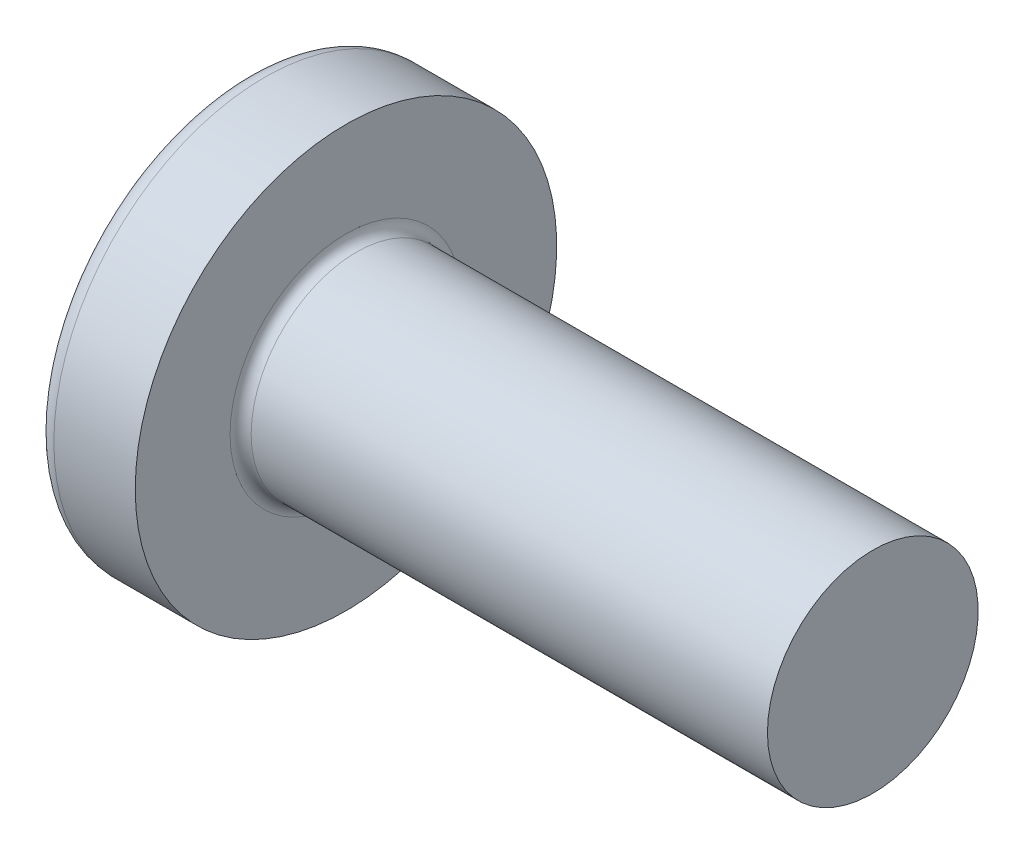
ISO-10303-21;
HEADER;
FILE_DESCRIPTION(('STEP AP214'),'2;1');
FILE_NAME('part.step','',(''),(''),'','','');
FILE_SCHEMA(('AUTOMOTIVE_DESIGN { 1 0 10303 214 1 1 1 1 }'));
ENDSEC;
DATA;
#1=APPLICATION_CONTEXT('core data for automotive mechanical design processes');
#2=APPLICATION_PROTOCOL_DEFINITION('international standard','automotive_design',2000,#1);
#3=PRODUCT_CONTEXT('',#1,'mechanical');
#4=PRODUCT('Part','Part','',(#3));
#5=PRODUCT_RELATED_PRODUCT_CATEGORY('part','',(#4));
#6=PRODUCT_DEFINITION_FORMATION('','',#4);
#7=PRODUCT_DEFINITION_CONTEXT('part definition',#1,'design');
#8=PRODUCT_DEFINITION('design','',#6,#7);
#9=PRODUCT_DEFINITION_SHAPE('','',#8);
#10=(LENGTH_UNIT() NAMED_UNIT(*) SI_UNIT(.MILLI.,.METRE.));
#11=(NAMED_UNIT(*) PLANE_ANGLE_UNIT() SI_UNIT($,.RADIAN.));
#12=(NAMED_UNIT(*) SI_UNIT($,.STERADIAN.) SOLID_ANGLE_UNIT());
#13=UNCERTAINTY_MEASURE_WITH_UNIT(LENGTH_MEASURE(1.E-05),#10,'distance_accuracy_value','');
#14=(GEOMETRIC_REPRESENTATION_CONTEXT(3) GLOBAL_UNCERTAINTY_ASSIGNED_CONTEXT((#13)) GLOBAL_UNIT_ASSIGNED_CONTEXT((#10,
#11,#12)) REPRESENTATION_CONTEXT('',''));
#15=CARTESIAN_POINT('',(0.,0.,0.));
#16=DIRECTION('',(0.,0.,1.));
#17=DIRECTION('',(1.,0.,0.));
#18=AXIS2_PLACEMENT_3D('',#15,#16,#17);
#19=CARTESIAN_POINT('',(0.,-2.15,-0.515));
#20=DIRECTION('',(0.446197753347436,-0.894934391398443,0.));
#21=DIRECTION('',(0.894934391398443,0.446197753347436,0.));
#22=AXIS2_PLACEMENT_3D('',#19,#20,#21);
#23=PLANE('',#22);
#24=DIRECTION('',(0.,0.,1.));
#25=VECTOR('',#24,1.);
#26=CARTESIAN_POINT('',(2.34,-0.983319232260743,-0.515));
#27=LINE('',#26,#25);
#28=CARTESIAN_POINT('',(2.34,-0.983319232260742,-0.515));
#29=VERTEX_POINT('',#28);
#30=CARTESIAN_POINT('',(2.34,-0.983319232260743,0.515));
#31=VERTEX_POINT('',#30);
#32=EDGE_CURVE('E152',#29,#31,#27,.T.);
#33=ORIENTED_EDGE('',*,*,#32,.F.);
#34=DIRECTION('',(0.894934391398443,0.446197753347436,0.));
#35=VECTOR('',#34,1.);
#36=CARTESIAN_POINT('',(0.331830520157853,-1.98455543332603,-0.515));
#37=LINE('',#36,#35);
#38=CARTESIAN_POINT('',(0.331830520157854,-1.98455543332603,-0.515));
#39=VERTEX_POINT('',#38);
#40=EDGE_CURVE('E156',#39,#29,#37,.T.);
#41=ORIENTED_EDGE('',*,*,#40,.F.);
#42=CARTESIAN_POINT('',(0.331830520157854,-1.98455543332603,0.514999999999998));
#43=CARTESIAN_POINT('',(0.319498798424873,-1.99070380194952,0.343333333333332));
#44=CARTESIAN_POINT('',(0.313332937558384,-1.99377798626127,0.171666666666665));
#45=CARTESIAN_POINT('',(0.313332937558389,-1.99377798626128,-0.171666666666671));
#46=CARTESIAN_POINT('',(0.319498798424884,-1.99070380194955,-0.343333333333342));
#47=CARTESIAN_POINT('',(0.331830520157871,-1.98455543332607,-0.515000000000013));
#48=B_SPLINE_CURVE_WITH_KNOTS('',3,(#42,#43,#44,#45,#46,#47),.UNSPECIFIED.,.F.,.F.,(4,2,4),(0.,
0.515414605967532,1.03082921193508),.UNSPECIFIED.);
#49=CARTESIAN_POINT('',(0.331830520157854,-1.98455543332603,0.515));
#50=VERTEX_POINT('',#49);
#51=EDGE_CURVE('E140',#50,#39,#48,.T.);
#52=ORIENTED_EDGE('',*,*,#51,.F.);
#53=DIRECTION('',(-0.894934391398443,-0.446197753347436,0.));
#54=VECTOR('',#53,1.);
#55=CARTESIAN_POINT('',(2.34,-0.983319232260743,0.515));
#56=LINE('',#55,#54);
#57=EDGE_CURVE('E170',#31,#50,#56,.T.);
#58=ORIENTED_EDGE('',*,*,#57,.F.);
#59=EDGE_LOOP('',(#33,#41,#52,#58));
#60=FACE_BOUND('',#59,.T.);
#61=ADVANCED_FACE('F17',(#60),#23,.F.);
#62=CARTESIAN_POINT('',(0.,-2.15,0.514999999999999));
#63=DIRECTION('',(0.,0.,-1.));
#64=DIRECTION('',(-1.,0.,0.));
#65=AXIS2_PLACEMENT_3D('',#62,#63,#64);
#66=PLANE('',#65);
#67=DIRECTION('',(0.,1.,0.));
#68=VECTOR('',#67,1.);
#69=CARTESIAN_POINT('',(2.34,-2.15,0.515));
#70=LINE('',#69,#68);
#71=CARTESIAN_POINT('',(2.34000000000175,-0.677477674907183,0.51499999999998));
#72=VERTEX_POINT('',#71);
#73=EDGE_CURVE('E334',#72,#31,#70,.F.);
#74=ORIENTED_EDGE('',*,*,#73,.T.);
#75=ORIENTED_EDGE('',*,*,#57,.T.);
#76=CARTESIAN_POINT('',(0.331830520157854,-1.98455543332603,0.515000000000001));
#77=CARTESIAN_POINT('',(0.273182530445949,-1.80216454181507,0.515000000000023));
#78=CARTESIAN_POINT('',(0.222773490743651,-1.61790695532938,0.515000000000022));
#79=CARTESIAN_POINT('',(0.138433311358271,-1.24565839240852,0.514999999999977));
#80=CARTESIAN_POINT('',(0.104502171675189,-1.05766741597335,0.514999999999933));
#81=CARTESIAN_POINT('',(0.0788099820017152,-0.867809744563443,0.514999999999866));
#82=B_SPLINE_CURVE_WITH_KNOTS('',3,(#76,#77,#78,#79,#80,#81),.UNSPECIFIED.,.F.,.F.,(4,2,4),(0.,
0.573085827037425,1.14617165407485),.UNSPECIFIED.);
#83=CARTESIAN_POINT('',(0.0788099820150379,-0.867809744561917,0.514999999999933));
#84=VERTEX_POINT('',#83);
#85=EDGE_CURVE('E147',#50,#84,#82,.T.);
#86=ORIENTED_EDGE('',*,*,#85,.T.);
#87=CARTESIAN_POINT('',(0.0788099820105211,-0.867809744561842,0.514999999999999));
#88=CARTESIAN_POINT('',(0.392213734002262,-0.842304642325876,0.514999999999999));
#89=CARTESIAN_POINT('',(0.70559787355606,-0.816547301111019,0.515));
#90=CARTESIAN_POINT('',(1.33229966547313,-0.76425626320608,0.515));
#91=CARTESIAN_POINT('',(1.64561731816469,-0.737722570443666,0.515));
#92=CARTESIAN_POINT('',(2.08593418824368,-0.69969155696372,0.515));
#93=CARTESIAN_POINT('',(2.21297124645575,-0.68863226058366,0.515));
#94=CARTESIAN_POINT('',(2.34000000000109,-0.677477674906791,0.515));
#95=B_SPLINE_CURVE_WITH_KNOTS('',3,(#87,#88,#89,#90,#91,#92,#93,#94),.UNSPECIFIED.,.F.,.F.,(4,2,
2,4),(0.,0.943320959581089,1.88663714759769,2.26918969179948),.UNSPECIFIED.);
#96=EDGE_CURVE('E159',#84,#72,#95,.T.);
#97=ORIENTED_EDGE('',*,*,#96,.T.);
#98=EDGE_LOOP('',(#74,#75,#86,#97));
#99=FACE_BOUND('',#98,.T.);
#100=ADVANCED_FACE('F509',(#99),#66,.T.);
#101=CARTESIAN_POINT('',(0.,2.15,-0.515));
#102=DIRECTION('',(0.,0.,1.));
#103=DIRECTION('',(1.,0.,0.));
#104=AXIS2_PLACEMENT_3D('',#101,#102,#103);
#105=PLANE('',#104);
#106=CARTESIAN_POINT('',(0.0788099820017082,-0.867809744563347,-0.515000000000002));
#107=CARTESIAN_POINT('',(0.104502171675179,-1.05766741597327,-0.515000000000001));
#108=CARTESIAN_POINT('',(0.138433311358259,-1.24565839240845,-0.515));
#109=CARTESIAN_POINT('',(0.222773490743641,-1.61790695532935,-0.515));
#110=CARTESIAN_POINT('',(0.273182530445943,-1.80216454181506,-0.514999999999999));
#111=CARTESIAN_POINT('',(0.331830520157854,-1.98455543332603,-0.514999999999999));
#112=B_SPLINE_CURVE_WITH_KNOTS('',3,(#106,#107,#108,#109,#110,#111),.UNSPECIFIED.,.F.,.F.,(4,2,
4),(0.,0.573085827037473,1.14617165407495),.UNSPECIFIED.);
#113=CARTESIAN_POINT('',(0.0788099820061147,-0.867809744562595,-0.515000000000001));
#114=VERTEX_POINT('',#113);
#115=EDGE_CURVE('E144',#114,#39,#112,.T.);
#116=ORIENTED_EDGE('',*,*,#115,.T.);
#117=ORIENTED_EDGE('',*,*,#40,.T.);
#118=DIRECTION('',(0.,1.,0.));
#119=VECTOR('',#118,1.);
#120=CARTESIAN_POINT('',(2.34,2.15,-0.515));
#121=LINE('',#120,#119);
#122=CARTESIAN_POINT('',(2.34000000000175,-0.677477674907168,-0.515));
#123=VERTEX_POINT('',#122);
#124=EDGE_CURVE('E166',#29,#123,#121,.T.);
#125=ORIENTED_EDGE('',*,*,#124,.T.);
#126=CARTESIAN_POINT('',(2.34000000000109,-0.677477674906791,-0.515));
#127=CARTESIAN_POINT('',(2.07584465982531,-0.700667758110798,-0.515));
#128=CARTESIAN_POINT('',(1.81165398196259,-0.723450497756089,-0.515));
#129=CARTESIAN_POINT('',(1.28321771173505,-0.768360358266413,-0.515));
#130=CARTESIAN_POINT('',(1.01897211955267,-0.79048748127564,-0.515));
#131=CARTESIAN_POINT('',(0.642063816057716,-0.821692201389346,-0.515));
#132=CARTESIAN_POINT('',(0.529417831854457,-0.830972904506625,-0.515));
#133=CARTESIAN_POINT('',(0.304118917866834,-0.849451547308498,-0.515));
#134=CARTESIAN_POINT('',(0.191465988073096,-0.858649486878829,-0.515));
#135=CARTESIAN_POINT('',(0.078809982010521,-0.867809744561842,-0.515));
#136=B_SPLINE_CURVE_WITH_KNOTS('',3,(#126,#127,#128,#129,#130,#131,#132,#133,#134,#135),
.UNSPECIFIED.,.F.,.F.,(4,2,2,2,4),(0.,0.795513032095966,1.59102346217911,1.93010639275618,
2.26918979140427),.UNSPECIFIED.);
#137=EDGE_CURVE('E163',#123,#114,#136,.T.);
#138=ORIENTED_EDGE('',*,*,#137,.T.);
#139=EDGE_LOOP('',(#116,#117,#125,#138));
#140=FACE_BOUND('',#139,.T.);
#141=ADVANCED_FACE('F161',(#140),#105,.T.);
#142=CARTESIAN_POINT('',(0.0788099821420474,0.,0.));
#143=DIRECTION('',(-1.,0.,0.));
#144=DIRECTION('',(0.,0.,1.));
#145=AXIS2_PLACEMENT_3D('',#142,#143,#144);
#146=CONICAL_SURFACE('',#145,1.00911780914714,0.0698131700804186);
#147=CARTESIAN_POINT('',(2.34000000000043,-0.515000000000002,0.677477674906847));
#148=CARTESIAN_POINT('',(2.07584465982464,-0.515000000000003,0.700667758110854));
#149=CARTESIAN_POINT('',(1.81165398196191,-0.515000000000003,0.723450497756147));
#150=CARTESIAN_POINT('',(1.28321771173434,-0.515000000000003,0.768360358266472));
#151=CARTESIAN_POINT('',(1.01897211955194,-0.515000000000002,0.790487481275699));
#152=CARTESIAN_POINT('',(0.642063816056353,-0.515000000000003,0.821692201389457));
#153=CARTESIAN_POINT('',(0.529417831852476,-0.515000000000003,0.830972904506786));
#154=CARTESIAN_POINT('',(0.304118917863614,-0.515000000000003,0.84945154730876));
#155=CARTESIAN_POINT('',(0.191465988069257,-0.515000000000003,0.85864948687914));
#156=CARTESIAN_POINT('',(0.0788099820060616,-0.515000000000003,0.867809744562203));
#157=B_SPLINE_CURVE_WITH_KNOTS('',3,(#147,#148,#149,#150,#151,#152,#153,#154,#155,#156),
.UNSPECIFIED.,.F.,.F.,(4,2,2,2,4),(0.,0.795513032096009,1.5910234621792,1.93010639275813,
2.26918979140808),.UNSPECIFIED.);
#158=CARTESIAN_POINT('',(2.34000000000175,-0.515000000000003,0.677477674907166));
#159=VERTEX_POINT('',#158);
#160=CARTESIAN_POINT('',(0.0788099820150116,-0.515000000000002,0.867809744611743));
#161=VERTEX_POINT('',#160);
#162=EDGE_CURVE('E315',#159,#161,#157,.T.);
#163=ORIENTED_EDGE('',*,*,#162,.F.);
#164=CARTESIAN_POINT('',(2.34000000000378,0.,0.));
#165=DIRECTION('',(-1.,0.,0.));
#166=DIRECTION('',(0.,0.,1.));
#167=AXIS2_PLACEMENT_3D('',#164,#165,#166);
#168=CIRCLE('',#167,0.850999999997271);
#169=EDGE_CURVE('E323',#72,#159,#168,.T.);
#170=ORIENTED_EDGE('',*,*,#169,.F.);
#171=ORIENTED_EDGE('',*,*,#96,.F.);
#172=CARTESIAN_POINT('',(0.0788099820283605,0.,0.));
#173=DIRECTION('',(-1.,0.,0.));
#174=DIRECTION('',(0.,0.,1.));
#175=AXIS2_PLACEMENT_3D('',#172,#173,#174);
#176=CIRCLE('',#175,1.00911780915509);
#177=EDGE_CURVE('E326',#161,#84,#176,.F.);
#178=ORIENTED_EDGE('',*,*,#177,.F.);
#179=EDGE_LOOP('',(#163,#170,#171,#178));
#180=FACE_BOUND('',#179,.T.);
#181=ADVANCED_FACE('F498',(#180),#146,.F.);
#182=CARTESIAN_POINT('',(0.0788099821420474,0.,0.));
#183=DIRECTION('',(-1.,0.,0.));
#184=DIRECTION('',(0.,0.,1.));
#185=AXIS2_PLACEMENT_3D('',#182,#183,#184);
#186=CONICAL_SURFACE('',#185,1.00911780914714,0.0698131700804186);
#187=CARTESIAN_POINT('',(0.0788099820060611,-0.514999999999996,-0.867809744562207));
#188=CARTESIAN_POINT('',(0.392213733997899,-0.514999999999996,-0.842304642326235));
#189=CARTESIAN_POINT('',(0.705597873551794,-0.514999999999997,-0.816547301111373));
#190=CARTESIAN_POINT('',(1.33229966546905,-0.514999999999997,-0.764256263206425));
#191=CARTESIAN_POINT('',(1.64561731816071,-0.514999999999997,-0.737722570444007));
#192=CARTESIAN_POINT('',(2.08593418824088,-0.514999999999997,-0.699691556963965));
#193=CARTESIAN_POINT('',(2.21297124645402,-0.514999999999997,-0.688632260583813));
#194=CARTESIAN_POINT('',(2.34000000000043,-0.514999999999998,-0.677477674906851));
#195=B_SPLINE_CURVE_WITH_KNOTS('',3,(#187,#188,#189,#190,#191,#192,#193,#194),.UNSPECIFIED.,.F.,
.F.,(4,2,2,4),(0.,0.94332095958138,1.88663714759827,2.2691896918033),.UNSPECIFIED.);
#196=CARTESIAN_POINT('',(0.0788099820172106,-0.514999999999994,-0.867809744611342));
#197=VERTEX_POINT('',#196);
#198=CARTESIAN_POINT('',(2.34000000000175,-0.514999999999998,-0.67747767490717));
#199=VERTEX_POINT('',#198);
#200=EDGE_CURVE('E308',#197,#199,#195,.T.);
#201=ORIENTED_EDGE('',*,*,#200,.F.);
#202=CARTESIAN_POINT('',(0.0788099820283605,0.,0.));
#203=DIRECTION('',(-1.,0.,0.));
#204=DIRECTION('',(0.,0.,1.));
#205=AXIS2_PLACEMENT_3D('',#202,#203,#204);
#206=CIRCLE('',#205,1.00911780915509);
#207=EDGE_CURVE('E322',#114,#197,#206,.F.);
#208=ORIENTED_EDGE('',*,*,#207,.F.);
#209=ORIENTED_EDGE('',*,*,#137,.F.);
#210=CARTESIAN_POINT('',(2.34000000000378,0.,0.));
#211=DIRECTION('',(-1.,0.,0.));
#212=DIRECTION('',(0.,0.,1.));
#213=AXIS2_PLACEMENT_3D('',#210,#211,#212);
#214=CIRCLE('',#213,0.850999999997271);
#215=EDGE_CURVE('E316',#199,#123,#214,.T.);
#216=ORIENTED_EDGE('',*,*,#215,.F.);
#217=EDGE_LOOP('',(#201,#208,#209,#216));
#218=FACE_BOUND('',#217,.T.);
#219=ADVANCED_FACE('F484',(#218),#186,.F.);
#220=CARTESIAN_POINT('',(0.,-0.514999999999992,-2.15));
#221=DIRECTION('',(0.,1.,0.));
#222=DIRECTION('',(0.,0.,1.));
#223=AXIS2_PLACEMENT_3D('',#220,#221,#222);
#224=PLANE('',#223);
#225=CARTESIAN_POINT('',(6.5,-0.515000000000002,0.));
#226=DIRECTION('',(0.,1.,0.));
#227=DIRECTION('',(0.,0.,1.));
#228=AXIS2_PLACEMENT_3D('',#225,#226,#227);
#229=CIRCLE('',#228,6.47956595768575);
#230=CARTESIAN_POINT('',(0.331830520157854,-0.515000000000004,1.98455543332603));
#231=VERTEX_POINT('',#230);
#232=EDGE_CURVE('E496',#161,#231,#229,.T.);
#233=ORIENTED_EDGE('',*,*,#232,.T.);
#234=DIRECTION('',(0.894934391398443,0.,-0.446197753347436));
#235=VECTOR('',#234,1.);
#236=CARTESIAN_POINT('',(2.34,-0.515000000000007,0.983319232260741));
#237=LINE('',#236,#235);
#238=CARTESIAN_POINT('',(2.34,-0.515000000000006,0.983319232260741));
#239=VERTEX_POINT('',#238);
#240=EDGE_CURVE('E293',#231,#239,#237,.T.);
#241=ORIENTED_EDGE('',*,*,#240,.T.);
#242=DIRECTION('',(0.,0.,1.));
#243=VECTOR('',#242,1.);
#244=CARTESIAN_POINT('',(2.34,-0.514999999999992,-2.15));
#245=LINE('',#244,#243);
#246=EDGE_CURVE('E311',#239,#159,#245,.F.);
#247=ORIENTED_EDGE('',*,*,#246,.T.);
#248=ORIENTED_EDGE('',*,*,#162,.T.);
#249=EDGE_LOOP('',(#233,#241,#247,#248));
#250=FACE_BOUND('',#249,.T.);
#251=ADVANCED_FACE('F480',(#250),#224,.T.);
#252=CARTESIAN_POINT('',(0.,-0.514999999999992,-2.15));
#253=DIRECTION('',(0.,1.,0.));
#254=DIRECTION('',(0.,0.,1.));
#255=AXIS2_PLACEMENT_3D('',#252,#253,#254);
#256=PLANE('',#255);
#257=DIRECTION('',(0.,0.,1.));
#258=VECTOR('',#257,1.);
#259=CARTESIAN_POINT('',(2.34,-0.514999999999992,-2.15));
#260=LINE('',#259,#258);
#261=CARTESIAN_POINT('',(2.34,-0.514999999999996,-0.983319232260743));
#262=VERTEX_POINT('',#261);
#263=EDGE_CURVE('E305',#199,#262,#260,.F.);
#264=ORIENTED_EDGE('',*,*,#263,.T.);
#265=DIRECTION('',(-0.894934391398443,0.,-0.446197753347436));
#266=VECTOR('',#265,1.);
#267=CARTESIAN_POINT('',(0.,-0.514999999999996,-2.15));
#268=LINE('',#267,#266);
#269=CARTESIAN_POINT('',(0.331830520157854,-0.514999999999992,-1.98455543332603));
#270=VERTEX_POINT('',#269);
#271=EDGE_CURVE('E281',#262,#270,#268,.T.);
#272=ORIENTED_EDGE('',*,*,#271,.T.);
#273=CARTESIAN_POINT('',(6.5,-0.514999999999992,0.));
#274=DIRECTION('',(0.,1.,0.));
#275=DIRECTION('',(0.,0.,1.));
#276=AXIS2_PLACEMENT_3D('',#273,#274,#275);
#277=CIRCLE('',#276,6.47956595768575);
#278=EDGE_CURVE('E765',#270,#197,#277,.T.);
#279=ORIENTED_EDGE('',*,*,#278,.T.);
#280=ORIENTED_EDGE('',*,*,#200,.T.);
#281=EDGE_LOOP('',(#264,#272,#279,#280));
#282=FACE_BOUND('',#281,.T.);
#283=ADVANCED_FACE('F475',(#282),#256,.T.);
#284=CARTESIAN_POINT('',(2.34,-0.515000000000004,0.983319232260741));
#285=DIRECTION('',(0.446197753347436,0.,0.894934391398443));
#286=DIRECTION('',(0.894934391398443,0.,-0.446197753347436));
#287=AXIS2_PLACEMENT_3D('',#284,#285,#286);
#288=PLANE('',#287);
#289=DIRECTION('',(0.,1.,0.));
#290=VECTOR('',#289,1.);
#291=CARTESIAN_POINT('',(2.34,-0.515000000000004,0.983319232260741));
#292=LINE('',#291,#290);
#293=CARTESIAN_POINT('',(2.34,0.514999999999997,0.983319232260743));
#294=VERTEX_POINT('',#293);
#295=EDGE_CURVE('E297',#239,#294,#292,.T.);
#296=ORIENTED_EDGE('',*,*,#295,.F.);
#297=ORIENTED_EDGE('',*,*,#240,.F.);
#298=CARTESIAN_POINT('',(0.331830520157854,0.514999999999994,1.98455543332603));
#299=CARTESIAN_POINT('',(0.319498798424876,0.343333333333328,1.99070380194953));
#300=CARTESIAN_POINT('',(0.313332937558386,0.171666666666661,1.99377798626128));
#301=CARTESIAN_POINT('',(0.313332937558386,-0.171666666666673,1.99377798626127));
#302=CARTESIAN_POINT('',(0.319498798424876,-0.34333333333334,1.99070380194953));
#303=CARTESIAN_POINT('',(0.331830520157854,-0.515000000000006,1.98455543332603));
#304=B_SPLINE_CURVE_WITH_KNOTS('',3,(#298,#299,#300,#301,#302,#303),.UNSPECIFIED.,.F.,.F.,(4,2,
4),(0.,0.515414605967534,1.03082921193507),.UNSPECIFIED.);
#305=CARTESIAN_POINT('',(0.331830520157854,0.514999999999988,1.98455543332604));
#306=VERTEX_POINT('',#305);
#307=EDGE_CURVE('E298',#306,#231,#304,.T.);
#308=ORIENTED_EDGE('',*,*,#307,.F.);
#309=DIRECTION('',(-0.894934391398443,0.,0.446197753347436));
#310=VECTOR('',#309,1.);
#311=CARTESIAN_POINT('',(2.34,0.514999999999997,0.983319232260744));
#312=LINE('',#311,#310);
#313=EDGE_CURVE('E274',#294,#306,#312,.T.);
#314=ORIENTED_EDGE('',*,*,#313,.F.);
#315=EDGE_LOOP('',(#296,#297,#308,#314));
#316=FACE_BOUND('',#315,.T.);
#317=ADVANCED_FACE('F472',(#316),#288,.F.);
#318=CARTESIAN_POINT('',(2.34,0.983319232260742,-0.515));
#319=DIRECTION('',(-1.,0.,0.));
#320=DIRECTION('',(0.,0.,1.));
#321=AXIS2_PLACEMENT_3D('',#318,#319,#320);
#322=PLANE('',#321);
#323=ORIENTED_EDGE('',*,*,#124,.F.);
#324=ORIENTED_EDGE('',*,*,#32,.T.);
#325=ORIENTED_EDGE('',*,*,#73,.F.);
#326=CARTESIAN_POINT('',(2.33999999999972,0.,0.));
#327=DIRECTION('',(-1.,0.,0.));
#328=DIRECTION('',(0.,0.,1.));
#329=AXIS2_PLACEMENT_3D('',#326,#327,#328);
#330=CIRCLE('',#329,0.850999999999935);
#331=EDGE_CURVE('E264',#72,#123,#330,.F.);
#332=ORIENTED_EDGE('',*,*,#331,.T.);
#333=EDGE_LOOP('',(#323,#324,#325,#332));
#334=FACE_BOUND('',#333,.T.);
#335=ADVANCED_FACE('F447',(#334),#322,.T.);
#336=CARTESIAN_POINT('',(0.,0.515000000000008,-2.15));
#337=DIRECTION('',(0.446197753347436,0.,-0.894934391398443));
#338=DIRECTION('',(-0.894934391398443,0.,-0.446197753347436));
#339=AXIS2_PLACEMENT_3D('',#336,#337,#338);
#340=PLANE('',#339);
#341=DIRECTION('',(0.,1.,0.));
#342=VECTOR('',#341,1.);
#343=CARTESIAN_POINT('',(2.34,0.983319232260742,-0.983319232260741));
#344=LINE('',#343,#342);
#345=CARTESIAN_POINT('',(2.34,0.515000000000003,-0.98331923226074));
#346=VERTEX_POINT('',#345);
#347=EDGE_CURVE('E271',#346,#262,#344,.F.);
#348=ORIENTED_EDGE('',*,*,#347,.F.);
#349=DIRECTION('',(0.894934391398443,0.,0.446197753347436));
#350=VECTOR('',#349,1.);
#351=CARTESIAN_POINT('',(0.331830520157856,0.515000000000007,-1.98455543332603));
#352=LINE('',#351,#350);
#353=CARTESIAN_POINT('',(0.331830520157855,0.51500000000001,-1.98455543332603));
#354=VERTEX_POINT('',#353);
#355=EDGE_CURVE('E252',#354,#346,#352,.T.);
#356=ORIENTED_EDGE('',*,*,#355,.F.);
#357=CARTESIAN_POINT('',(0.331830520157855,-0.514999999999994,-1.98455543332604));
#358=CARTESIAN_POINT('',(0.319498798424876,-0.343333333333327,-1.99070380194953));
#359=CARTESIAN_POINT('',(0.313332937558386,-0.17166666666666,-1.99377798626128));
#360=CARTESIAN_POINT('',(0.313332937558387,0.171666666666674,-1.99377798626127));
#361=CARTESIAN_POINT('',(0.319498798424876,0.343333333333341,-1.99070380194953));
#362=CARTESIAN_POINT('',(0.331830520157856,0.515000000000007,-1.98455543332603));
#363=B_SPLINE_CURVE_WITH_KNOTS('',3,(#357,#358,#359,#360,#361,#362),.UNSPECIFIED.,.F.,.F.,(4,2,
4),(0.,0.515414605967534,1.03082921193507),.UNSPECIFIED.);
#364=EDGE_CURVE('E285',#270,#354,#363,.T.);
#365=ORIENTED_EDGE('',*,*,#364,.F.);
#366=ORIENTED_EDGE('',*,*,#271,.F.);
#367=EDGE_LOOP('',(#348,#356,#365,#366));
#368=FACE_BOUND('',#367,.T.);
#369=ADVANCED_FACE('F442',(#368),#340,.F.);
#370=CARTESIAN_POINT('',(0.,0.514999999999993,2.15));
#371=DIRECTION('',(0.,-1.,0.));
#372=DIRECTION('',(0.,0.,-1.));
#373=AXIS2_PLACEMENT_3D('',#370,#371,#372);
#374=PLANE('',#373);
#375=DIRECTION('',(0.,0.,1.));
#376=VECTOR('',#375,1.);
#377=CARTESIAN_POINT('',(2.34,0.514999999999997,-0.515));
#378=LINE('',#377,#376);
#379=CARTESIAN_POINT('',(2.34000000000009,0.514999999999978,0.677477674907863));
#380=VERTEX_POINT('',#379);
#381=EDGE_CURVE('E267',#294,#380,#378,.F.);
#382=ORIENTED_EDGE('',*,*,#381,.F.);
#383=ORIENTED_EDGE('',*,*,#313,.T.);
#384=CARTESIAN_POINT('',(6.5,0.514999999999993,0.));
#385=DIRECTION('',(0.,1.,0.));
#386=DIRECTION('',(0.,0.,1.));
#387=AXIS2_PLACEMENT_3D('',#384,#385,#386);
#388=CIRCLE('',#387,6.47956595768575);
#389=CARTESIAN_POINT('',(0.0788099820150342,0.514999999999993,0.867809744611911));
#390=VERTEX_POINT('',#389);
#391=EDGE_CURVE('E278',#306,#390,#388,.F.);
#392=ORIENTED_EDGE('',*,*,#391,.T.);
#393=CARTESIAN_POINT('',(0.0788099820105218,0.514999999999997,0.867809744561844));
#394=CARTESIAN_POINT('',(0.392213734002263,0.514999999999997,0.842304642325877));
#395=CARTESIAN_POINT('',(0.705597873556061,0.514999999999997,0.81654730111102));
#396=CARTESIAN_POINT('',(1.33229966547313,0.514999999999997,0.764256263206081));
#397=CARTESIAN_POINT('',(1.64561731816469,0.514999999999998,0.737722570443667));
#398=CARTESIAN_POINT('',(2.08593418824345,0.514999999999998,0.699691556963741));
#399=CARTESIAN_POINT('',(2.21297124645529,0.514999999999998,0.688632260583701));
#400=CARTESIAN_POINT('',(2.3400000000004,0.514999999999998,0.677477674906854));
#401=B_SPLINE_CURVE_WITH_KNOTS('',3,(#393,#394,#395,#396,#397,#398,#399,#400),.UNSPECIFIED.,.F.,
.F.,(4,2,2,4),(0.,0.943320959581089,1.88663714759769,2.26918969179879),.UNSPECIFIED.);
#402=EDGE_CURVE('E425',#390,#380,#401,.T.);
#403=ORIENTED_EDGE('',*,*,#402,.T.);
#404=EDGE_LOOP('',(#382,#383,#392,#403));
#405=FACE_BOUND('',#404,.T.);
#406=ADVANCED_FACE('F436',(#405),#374,.T.);
#407=CARTESIAN_POINT('',(2.34,0.983319232260742,-0.515));
#408=DIRECTION('',(-1.,0.,0.));
#409=DIRECTION('',(0.,0.,1.));
#410=AXIS2_PLACEMENT_3D('',#407,#408,#409);
#411=PLANE('',#410);
#412=DIRECTION('',(0.,0.,-1.));
#413=VECTOR('',#412,1.);
#414=CARTESIAN_POINT('',(2.34,0.514999999999993,2.15));
#415=LINE('',#414,#413);
#416=CARTESIAN_POINT('',(2.34000000000175,0.514999999999983,-0.677477674907181));
#417=VERTEX_POINT('',#416);
#418=EDGE_CURVE('E260',#346,#417,#415,.F.);
#419=ORIENTED_EDGE('',*,*,#418,.F.);
#420=ORIENTED_EDGE('',*,*,#347,.T.);
#421=ORIENTED_EDGE('',*,*,#263,.F.);
#422=CARTESIAN_POINT('',(2.33999999999972,0.,0.));
#423=DIRECTION('',(-1.,0.,0.));
#424=DIRECTION('',(0.,0.,1.));
#425=AXIS2_PLACEMENT_3D('',#422,#423,#424);
#426=CIRCLE('',#425,0.850999999999935);
#427=EDGE_CURVE('E251',#199,#417,#426,.F.);
#428=ORIENTED_EDGE('',*,*,#427,.T.);
#429=EDGE_LOOP('',(#419,#420,#421,#428));
#430=FACE_BOUND('',#429,.T.);
#431=ADVANCED_FACE('F441',(#430),#411,.T.);
#432=CARTESIAN_POINT('',(2.34,0.983319232260742,-0.515));
#433=DIRECTION('',(-1.,0.,0.));
#434=DIRECTION('',(0.,0.,1.));
#435=AXIS2_PLACEMENT_3D('',#432,#433,#434);
#436=PLANE('',#435);
#437=ORIENTED_EDGE('',*,*,#246,.F.);
#438=ORIENTED_EDGE('',*,*,#295,.T.);
#439=ORIENTED_EDGE('',*,*,#381,.T.);
#440=CARTESIAN_POINT('',(2.33999999999972,0.,0.));
#441=DIRECTION('',(-1.,0.,0.));
#442=DIRECTION('',(0.,0.,1.));
#443=AXIS2_PLACEMENT_3D('',#440,#441,#442);
#444=CIRCLE('',#443,0.850999999999935);
#445=EDGE_CURVE('E246',#380,#159,#444,.F.);
#446=ORIENTED_EDGE('',*,*,#445,.T.);
#447=EDGE_LOOP('',(#437,#438,#439,#446));
#448=FACE_BOUND('',#447,.T.);
#449=ADVANCED_FACE('F667',(#448),#436,.T.);
#450=CARTESIAN_POINT('',(0.,0.514999999999993,2.15));
#451=DIRECTION('',(0.,-1.,0.));
#452=DIRECTION('',(0.,0.,-1.));
#453=AXIS2_PLACEMENT_3D('',#450,#451,#452);
#454=PLANE('',#453);
#455=CARTESIAN_POINT('',(6.5,0.515000000000003,0.));
#456=DIRECTION('',(0.,1.,0.));
#457=DIRECTION('',(0.,0.,1.));
#458=AXIS2_PLACEMENT_3D('',#455,#456,#457);
#459=CIRCLE('',#458,6.47956595768574);
#460=CARTESIAN_POINT('',(0.0788099820150344,0.515000000000003,-0.867809744611907));
#461=VERTEX_POINT('',#460);
#462=EDGE_CURVE('E257',#461,#354,#459,.F.);
#463=ORIENTED_EDGE('',*,*,#462,.T.);
#464=ORIENTED_EDGE('',*,*,#355,.T.);
#465=ORIENTED_EDGE('',*,*,#418,.T.);
#466=CARTESIAN_POINT('',(2.34000000000109,0.515000000000003,-0.677477674906789));
#467=CARTESIAN_POINT('',(2.07584465982531,0.515000000000003,-0.700667758110796));
#468=CARTESIAN_POINT('',(1.81165398196259,0.515000000000003,-0.723450497756088));
#469=CARTESIAN_POINT('',(1.28321771173505,0.515000000000003,-0.768360358266412));
#470=CARTESIAN_POINT('',(1.01897211955267,0.515000000000003,-0.790487481275638));
#471=CARTESIAN_POINT('',(0.642063816057716,0.515000000000003,-0.821692201389344));
#472=CARTESIAN_POINT('',(0.529417831854458,0.515000000000003,-0.830972904506623));
#473=CARTESIAN_POINT('',(0.304118917866835,0.515000000000003,-0.849451547308497));
#474=CARTESIAN_POINT('',(0.191465988073097,0.515000000000003,-0.858649486878827));
#475=CARTESIAN_POINT('',(0.0788099820105217,0.515000000000003,-0.86780974456184));
#476=B_SPLINE_CURVE_WITH_KNOTS('',3,(#466,#467,#468,#469,#470,#471,#472,#473,#474,#475),
.UNSPECIFIED.,.F.,.F.,(4,2,2,2,4),(0.,0.795513032095966,1.59102346217911,1.93010639275618,
2.26918979140427),.UNSPECIFIED.);
#477=EDGE_CURVE('E245',#417,#461,#476,.T.);
#478=ORIENTED_EDGE('',*,*,#477,.T.);
#479=EDGE_LOOP('',(#463,#464,#465,#478));
#480=FACE_BOUND('',#479,.T.);
#481=ADVANCED_FACE('F419',(#480),#454,.T.);
#482=CARTESIAN_POINT('',(0.0788099821420474,0.,0.));
#483=DIRECTION('',(-1.,0.,0.));
#484=DIRECTION('',(0.,0.,1.));
#485=AXIS2_PLACEMENT_3D('',#482,#483,#484);
#486=CONICAL_SURFACE('',#485,1.00911780914714,0.0698131700804186);
#487=ORIENTED_EDGE('',*,*,#402,.F.);
#488=CARTESIAN_POINT('',(0.0788099820283605,0.,0.));
#489=DIRECTION('',(-1.,0.,0.));
#490=DIRECTION('',(0.,0.,1.));
#491=AXIS2_PLACEMENT_3D('',#488,#489,#490);
#492=CIRCLE('',#491,1.00911780915509);
#493=CARTESIAN_POINT('',(0.0788099820150127,0.867809744561701,0.515));
#494=VERTEX_POINT('',#493);
#495=EDGE_CURVE('E256',#494,#390,#492,.F.);
#496=ORIENTED_EDGE('',*,*,#495,.F.);
#497=CARTESIAN_POINT('',(2.33999999999974,0.67747767490691,0.515));
#498=CARTESIAN_POINT('',(2.07584465982393,0.700667758110917,0.515));
#499=CARTESIAN_POINT('',(1.81165398196119,0.72345049775621,0.515));
#500=CARTESIAN_POINT('',(1.28321771173358,0.768360358266537,0.515));
#501=CARTESIAN_POINT('',(1.01897211955117,0.790487481275765,0.515));
#502=CARTESIAN_POINT('',(0.642063816055702,0.821692201389512,0.515));
#503=CARTESIAN_POINT('',(0.529417831851954,0.830972904506831,0.515));
#504=CARTESIAN_POINT('',(0.304118917863353,0.849451547308783,0.515));
#505=CARTESIAN_POINT('',(0.191465988069127,0.858649486879153,0.515));
#506=CARTESIAN_POINT('',(0.078809982006062,0.867809744562205,0.515));
#507=B_SPLINE_CURVE_WITH_KNOTS('',3,(#497,#498,#499,#500,#501,#502,#503,#504,#505,#506),
.UNSPECIFIED.,.F.,.F.,(4,2,2,2,4),(0.,0.795513032096054,1.59102346217929,1.93010639275782,
2.26918979140739),.UNSPECIFIED.);
#508=CARTESIAN_POINT('',(2.33999999999976,0.67747767490789,0.51499999999998));
#509=VERTEX_POINT('',#508);
#510=EDGE_CURVE('E403',#509,#494,#507,.T.);
#511=ORIENTED_EDGE('',*,*,#510,.F.);
#512=CARTESIAN_POINT('',(2.33999999999979,0.,0.));
#513=DIRECTION('',(-1.,0.,0.));
#514=DIRECTION('',(0.,0.,1.));
#515=AXIS2_PLACEMENT_3D('',#512,#513,#514);
#516=CIRCLE('',#515,0.850999999999935);
#517=EDGE_CURVE('E247',#509,#380,#516,.F.);
#518=ORIENTED_EDGE('',*,*,#517,.T.);
#519=EDGE_LOOP('',(#487,#496,#511,#518));
#520=FACE_BOUND('',#519,.T.);
#521=ADVANCED_FACE('F414',(#520),#486,.F.);
#522=CARTESIAN_POINT('',(2.34000000000001,0.,0.));
#523=DIRECTION('',(-1.,0.,0.));
#524=DIRECTION('',(0.,0.,1.));
#525=AXIS2_PLACEMENT_3D('',#522,#523,#524);
#526=CONICAL_SURFACE('',#525,0.850999999999047,1.25663706143483);
#527=CARTESIAN_POINT('',(2.61650666149399,0.,0.));
#528=VERTEX_POINT('',#527);
#529=VERTEX_LOOP('',#528);
#530=FACE_BOUND('',#529,.T.);
#531=ORIENTED_EDGE('',*,*,#169,.T.);
#532=ORIENTED_EDGE('',*,*,#445,.F.);
#533=ORIENTED_EDGE('',*,*,#517,.F.);
#534=CARTESIAN_POINT('',(2.33999999999972,0.,0.));
#535=DIRECTION('',(-1.,0.,0.));
#536=DIRECTION('',(0.,0.,1.));
#537=AXIS2_PLACEMENT_3D('',#534,#535,#536);
#538=CIRCLE('',#537,0.850999999999935);
#539=CARTESIAN_POINT('',(2.34000000000175,0.677477674907183,-0.51499999999998));
#540=VERTEX_POINT('',#539);
#541=EDGE_CURVE('E238',#540,#509,#538,.F.);
#542=ORIENTED_EDGE('',*,*,#541,.F.);
#543=CARTESIAN_POINT('',(2.34000000000378,0.,0.));
#544=DIRECTION('',(-1.,0.,0.));
#545=DIRECTION('',(0.,0.,1.));
#546=AXIS2_PLACEMENT_3D('',#543,#544,#545);
#547=CIRCLE('',#546,0.850999999997271);
#548=EDGE_CURVE('E241',#540,#417,#547,.T.);
#549=ORIENTED_EDGE('',*,*,#548,.T.);
#550=ORIENTED_EDGE('',*,*,#427,.F.);
#551=ORIENTED_EDGE('',*,*,#215,.T.);
#552=ORIENTED_EDGE('',*,*,#331,.F.);
#553=EDGE_LOOP('',(#531,#532,#533,#542,#549,#550,#551,#552));
#554=FACE_BOUND('',#553,.T.);
#555=ADVANCED_FACE('F418',(#530,#554),#526,.F.);
#556=CARTESIAN_POINT('',(0.0788099821420474,0.,0.));
#557=DIRECTION('',(-1.,0.,0.));
#558=DIRECTION('',(0.,0.,1.));
#559=AXIS2_PLACEMENT_3D('',#556,#557,#558);
#560=CONICAL_SURFACE('',#559,1.00911780914714,0.0698131700804186);
#561=ORIENTED_EDGE('',*,*,#477,.F.);
#562=ORIENTED_EDGE('',*,*,#548,.F.);
#563=CARTESIAN_POINT('',(0.078809982006062,0.867809744562205,-0.515));
#564=CARTESIAN_POINT('',(0.3922137339979,0.842304642326233,-0.515));
#565=CARTESIAN_POINT('',(0.705597873551795,0.816547301111371,-0.515));
#566=CARTESIAN_POINT('',(1.33229966546906,0.764256263206423,-0.515));
#567=CARTESIAN_POINT('',(1.64561731816071,0.737722570444005,-0.515));
#568=CARTESIAN_POINT('',(2.08593418824088,0.699691556963963,-0.515));
#569=CARTESIAN_POINT('',(2.21297124645402,0.688632260583811,-0.515));
#570=CARTESIAN_POINT('',(2.34000000000043,0.677477674906849,-0.515));
#571=B_SPLINE_CURVE_WITH_KNOTS('',3,(#563,#564,#565,#566,#567,#568,#569,#570),.UNSPECIFIED.,.F.,
.F.,(4,2,2,4),(0.,0.94332095958138,1.88663714759827,2.2691896918033),.UNSPECIFIED.);
#572=CARTESIAN_POINT('',(0.0788099820172113,0.867809744561298,-0.515));
#573=VERTEX_POINT('',#572);
#574=EDGE_CURVE('E226',#573,#540,#571,.T.);
#575=ORIENTED_EDGE('',*,*,#574,.F.);
#576=CARTESIAN_POINT('',(0.0788099820283605,0.,0.));
#577=DIRECTION('',(-1.,0.,0.));
#578=DIRECTION('',(0.,0.,1.));
#579=AXIS2_PLACEMENT_3D('',#576,#577,#578);
#580=CIRCLE('',#579,1.00911780915509);
#581=EDGE_CURVE('E412',#461,#573,#580,.F.);
#582=ORIENTED_EDGE('',*,*,#581,.F.);
#583=EDGE_LOOP('',(#561,#562,#575,#582));
#584=FACE_BOUND('',#583,.T.);
#585=ADVANCED_FACE('F378',(#584),#560,.F.);
#586=CARTESIAN_POINT('',(0.,-2.15,0.514999999999999));
#587=DIRECTION('',(0.,0.,-1.));
#588=DIRECTION('',(-1.,0.,0.));
#589=AXIS2_PLACEMENT_3D('',#586,#587,#588);
#590=PLANE('',#589);
#591=CARTESIAN_POINT('',(0.0788099820016649,0.86780974456301,0.515));
#592=CARTESIAN_POINT('',(0.104502171675132,1.05766741597299,0.515));
#593=CARTESIAN_POINT('',(0.138433311358215,1.24565839240823,0.515));
#594=CARTESIAN_POINT('',(0.222773490743613,1.61790695532924,0.515));
#595=CARTESIAN_POINT('',(0.273182530445927,1.80216454181501,0.515));
#596=CARTESIAN_POINT('',(0.331830520157858,1.98455543332603,0.515000000000001));
#597=B_SPLINE_CURVE_WITH_KNOTS('',3,(#591,#592,#593,#594,#595,#596),.UNSPECIFIED.,.F.,.F.,(4,2,
4),(0.,0.573085827037642,1.14617165407528),.UNSPECIFIED.);
#598=CARTESIAN_POINT('',(0.331830520157858,1.98455543332603,0.514999999999999));
#599=VERTEX_POINT('',#598);
#600=EDGE_CURVE('E397',#494,#599,#597,.T.);
#601=ORIENTED_EDGE('',*,*,#600,.T.);
#602=DIRECTION('',(-0.894934391398443,0.446197753347436,0.));
#603=VECTOR('',#602,1.);
#604=CARTESIAN_POINT('',(2.34,0.983319232260742,0.515));
#605=LINE('',#604,#603);
#606=CARTESIAN_POINT('',(2.34,0.983319232260743,0.515));
#607=VERTEX_POINT('',#606);
#608=EDGE_CURVE('E217',#599,#607,#605,.F.);
#609=ORIENTED_EDGE('',*,*,#608,.T.);
#610=DIRECTION('',(0.,1.,0.));
#611=VECTOR('',#610,1.);
#612=CARTESIAN_POINT('',(2.34,0.983319232260742,0.515));
#613=LINE('',#612,#611);
#614=EDGE_CURVE('E233',#509,#607,#613,.T.);
#615=ORIENTED_EDGE('',*,*,#614,.F.);
#616=ORIENTED_EDGE('',*,*,#510,.T.);
#617=EDGE_LOOP('',(#601,#609,#615,#616));
#618=FACE_BOUND('',#617,.T.);
#619=ADVANCED_FACE('F390',(#618),#590,.T.);
#620=CARTESIAN_POINT('',(2.34,0.983319232260742,-0.515));
#621=DIRECTION('',(-1.,0.,0.));
#622=DIRECTION('',(0.,0.,1.));
#623=AXIS2_PLACEMENT_3D('',#620,#621,#622);
#624=PLANE('',#623);
#625=ORIENTED_EDGE('',*,*,#614,.T.);
#626=DIRECTION('',(0.,0.,1.));
#627=VECTOR('',#626,1.);
#628=CARTESIAN_POINT('',(2.34,0.983319232260742,0.515));
#629=LINE('',#628,#627);
#630=CARTESIAN_POINT('',(2.34,0.983319232260743,-0.515));
#631=VERTEX_POINT('',#630);
#632=EDGE_CURVE('E214',#607,#631,#629,.F.);
#633=ORIENTED_EDGE('',*,*,#632,.T.);
#634=DIRECTION('',(0.,1.,0.));
#635=VECTOR('',#634,1.);
#636=CARTESIAN_POINT('',(2.34,2.15,-0.515));
#637=LINE('',#636,#635);
#638=EDGE_CURVE('E220',#540,#631,#637,.T.);
#639=ORIENTED_EDGE('',*,*,#638,.F.);
#640=ORIENTED_EDGE('',*,*,#541,.T.);
#641=EDGE_LOOP('',(#625,#633,#639,#640));
#642=FACE_BOUND('',#641,.T.);
#643=ADVANCED_FACE('F386',(#642),#624,.T.);
#644=CARTESIAN_POINT('',(0.,2.15,-0.515));
#645=DIRECTION('',(0.,0.,1.));
#646=DIRECTION('',(1.,0.,0.));
#647=AXIS2_PLACEMENT_3D('',#644,#645,#646);
#648=PLANE('',#647);
#649=ORIENTED_EDGE('',*,*,#638,.T.);
#650=DIRECTION('',(-0.894934391398443,0.446197753347436,0.));
#651=VECTOR('',#650,1.);
#652=CARTESIAN_POINT('',(2.34,0.983319232260742,-0.515));
#653=LINE('',#652,#651);
#654=CARTESIAN_POINT('',(0.331830520157857,1.98455543332603,-0.514999999999999));
#655=VERTEX_POINT('',#654);
#656=EDGE_CURVE('E209',#631,#655,#653,.T.);
#657=ORIENTED_EDGE('',*,*,#656,.T.);
#658=CARTESIAN_POINT('',(0.331830520157858,1.98455543332603,-0.514999999999999));
#659=CARTESIAN_POINT('',(0.273182530445934,1.80216454181502,-0.515000000000021));
#660=CARTESIAN_POINT('',(0.222773490743623,1.61790695532927,-0.515000000000022));
#661=CARTESIAN_POINT('',(0.138433311358227,1.2456583924083,-0.514999999999979));
#662=CARTESIAN_POINT('',(0.104502171675143,1.05766741597307,-0.514999999999935));
#663=CARTESIAN_POINT('',(0.0788099820016718,0.867809744563107,-0.51499999999987));
#664=B_SPLINE_CURVE_WITH_KNOTS('',3,(#658,#659,#660,#661,#662,#663),.UNSPECIFIED.,.F.,.F.,(4,2,
4),(0.,0.573085827037594,1.14617165407519),.UNSPECIFIED.);
#665=EDGE_CURVE('E237',#655,#573,#664,.T.);
#666=ORIENTED_EDGE('',*,*,#665,.T.);
#667=ORIENTED_EDGE('',*,*,#574,.T.);
#668=EDGE_LOOP('',(#649,#657,#666,#667));
#669=FACE_BOUND('',#668,.T.);
#670=ADVANCED_FACE('F382',(#669),#648,.T.);
#671=CARTESIAN_POINT('',(2.34,0.983319232260742,0.515));
#672=DIRECTION('',(0.446197753347436,0.894934391398443,0.));
#673=DIRECTION('',(-0.894934391398443,0.446197753347436,0.));
#674=AXIS2_PLACEMENT_3D('',#671,#672,#673);
#675=PLANE('',#674);
#676=ORIENTED_EDGE('',*,*,#632,.F.);
#677=ORIENTED_EDGE('',*,*,#608,.F.);
#678=CARTESIAN_POINT('',(0.331830520157858,1.98455543332603,-0.514999999999999));
#679=CARTESIAN_POINT('',(0.319498798424884,1.99070380194954,-0.343333333333333));
#680=CARTESIAN_POINT('',(0.313332937558398,1.9937779862613,-0.171666666666667));
#681=CARTESIAN_POINT('',(0.313332937558402,1.99377798626131,0.17166666666667));
#682=CARTESIAN_POINT('',(0.319498798424893,1.99070380194956,0.34333333333334));
#683=CARTESIAN_POINT('',(0.331830520157872,1.98455543332607,0.515000000000011));
#684=B_SPLINE_CURVE_WITH_KNOTS('',3,(#678,#679,#680,#681,#682,#683),.UNSPECIFIED.,.F.,.F.,(4,2,
4),(0.,0.515414605967532,1.03082921193508),.UNSPECIFIED.);
#685=EDGE_CURVE('E213',#655,#599,#684,.T.);
#686=ORIENTED_EDGE('',*,*,#685,.F.);
#687=ORIENTED_EDGE('',*,*,#656,.F.);
#688=EDGE_LOOP('',(#676,#677,#686,#687));
#689=FACE_BOUND('',#688,.T.);
#690=ADVANCED_FACE('F197',(#689),#675,.F.);
#691=CARTESIAN_POINT('',(6.5,0.,0.));
#692=DIRECTION('',(0.,1.,0.));
#693=DIRECTION('',(1.,0.,0.));
#694=AXIS2_PLACEMENT_3D('',#691,#692,#693);
#695=SPHERICAL_SURFACE('',#694,6.5);
#696=CARTESIAN_POINT('',(1.26538895452803,0.,0.));
#697=DIRECTION('',(-1.,0.,0.));
#698=DIRECTION('',(0.,0.,1.));
#699=AXIS2_PLACEMENT_3D('',#696,#697,#698);
#700=CIRCLE('',#699,3.85342019543974);
#701=CARTESIAN_POINT('',(1.26538895452803,0.,3.85342019543974));
#702=VERTEX_POINT('',#701);
#703=EDGE_CURVE('E355',#702,#702,#700,.F.);
#704=ORIENTED_EDGE('',*,*,#703,.F.);
#705=EDGE_LOOP('',(#704));
#706=FACE_BOUND('',#705,.T.);
#707=ORIENTED_EDGE('',*,*,#85,.F.);
#708=ORIENTED_EDGE('',*,*,#51,.T.);
#709=ORIENTED_EDGE('',*,*,#115,.F.);
#710=ORIENTED_EDGE('',*,*,#207,.T.);
#711=ORIENTED_EDGE('',*,*,#278,.F.);
#712=ORIENTED_EDGE('',*,*,#364,.T.);
#713=ORIENTED_EDGE('',*,*,#462,.F.);
#714=ORIENTED_EDGE('',*,*,#581,.T.);
#715=ORIENTED_EDGE('',*,*,#665,.F.);
#716=ORIENTED_EDGE('',*,*,#685,.T.);
#717=ORIENTED_EDGE('',*,*,#600,.F.);
#718=ORIENTED_EDGE('',*,*,#495,.T.);
#719=ORIENTED_EDGE('',*,*,#391,.F.);
#720=ORIENTED_EDGE('',*,*,#307,.T.);
#721=ORIENTED_EDGE('',*,*,#232,.F.);
#722=ORIENTED_EDGE('',*,*,#177,.T.);
#723=EDGE_LOOP('',(#707,#708,#709,#710,#711,#712,#713,#714,#715,#716,#717,#718,#719,#720,#721,#722));
#724=FACE_BOUND('',#723,.T.);
#725=ADVANCED_FACE('F142',(#706,#724),#695,.T.);
#726=CARTESIAN_POINT('',(1.55530587396956,0.,0.));
#727=DIRECTION('',(-1.,0.,0.));
#728=DIRECTION('',(0.,0.,1.));
#729=AXIS2_PLACEMENT_3D('',#726,#727,#728);
#730=TOROIDAL_SURFACE('',#729,3.64,0.36);
#731=ORIENTED_EDGE('',*,*,#703,.T.);
#732=EDGE_LOOP('',(#731));
#733=FACE_BOUND('',#732,.T.);
#734=CARTESIAN_POINT('',(1.55530587396956,0.,0.));
#735=DIRECTION('',(-1.,0.,0.));
#736=DIRECTION('',(0.,0.,1.));
#737=AXIS2_PLACEMENT_3D('',#734,#735,#736);
#738=CIRCLE('',#737,4.);
#739=CARTESIAN_POINT('',(1.55530587396956,0.,4.));
#740=VERTEX_POINT('',#739);
#741=EDGE_CURVE('E354',#740,#740,#738,.F.);
#742=ORIENTED_EDGE('',*,*,#741,.F.);
#743=EDGE_LOOP('',(#742));
#744=FACE_BOUND('',#743,.T.);
#745=ADVANCED_FACE('F196',(#733,#744),#730,.T.);
#746=CARTESIAN_POINT('',(-25.4,0.,0.));
#747=DIRECTION('',(-1.,0.,0.));
#748=DIRECTION('',(0.,0.,1.));
#749=AXIS2_PLACEMENT_3D('',#746,#747,#748);
#750=CYLINDRICAL_SURFACE('',#749,4.);
#751=ORIENTED_EDGE('',*,*,#741,.T.);
#752=EDGE_LOOP('',(#751));
#753=FACE_BOUND('',#752,.T.);
#754=CARTESIAN_POINT('',(3.1,0.,0.));
#755=DIRECTION('',(-1.,0.,0.));
#756=DIRECTION('',(0.,0.,1.));
#757=AXIS2_PLACEMENT_3D('',#754,#755,#756);
#758=CIRCLE('',#757,4.);
#759=CARTESIAN_POINT('',(3.1,0.,4.));
#760=VERTEX_POINT('',#759);
#761=EDGE_CURVE('E349',#760,#760,#758,.T.);
#762=ORIENTED_EDGE('',*,*,#761,.T.);
#763=EDGE_LOOP('',(#762));
#764=FACE_BOUND('',#763,.T.);
#765=ADVANCED_FACE('F542',(#753,#764),#750,.T.);
#766=CARTESIAN_POINT('',(3.1,2.,0.));
#767=DIRECTION('',(-1.,0.,0.));
#768=DIRECTION('',(0.,0.,1.));
#769=AXIS2_PLACEMENT_3D('',#766,#767,#768);
#770=PLANE('',#769);
#771=ORIENTED_EDGE('',*,*,#761,.F.);
#772=EDGE_LOOP('',(#771));
#773=FACE_BOUND('',#772,.T.);
#774=CARTESIAN_POINT('',(3.1,0.,0.));
#775=DIRECTION('',(1.,0.,0.));
#776=DIRECTION('',(0.,0.,1.));
#777=AXIS2_PLACEMENT_3D('',#774,#775,#776);
#778=CIRCLE('',#777,2.2);
#779=CARTESIAN_POINT('',(3.1,0.,-2.2));
#780=VERTEX_POINT('',#779);
#781=CARTESIAN_POINT('',(3.1,0.,2.2));
#782=VERTEX_POINT('',#781);
#783=EDGE_CURVE('E353',#780,#782,#778,.F.);
#784=ORIENTED_EDGE('',*,*,#783,.T.);
#785=CARTESIAN_POINT('',(3.1,0.,0.));
#786=DIRECTION('',(1.,0.,0.));
#787=DIRECTION('',(0.,0.,-1.));
#788=AXIS2_PLACEMENT_3D('',#785,#786,#787);
#789=CIRCLE('',#788,2.2);
#790=EDGE_CURVE('E38',#782,#780,#789,.F.);
#791=ORIENTED_EDGE('',*,*,#790,.T.);
#792=EDGE_LOOP('',(#784,#791));
#793=FACE_BOUND('',#792,.T.);
#794=ADVANCED_FACE('F534',(#773,#793),#770,.F.);
#795=CARTESIAN_POINT('',(13.1,2.,0.));
#796=DIRECTION('',(1.,0.,0.));
#797=DIRECTION('',(0.,0.,-1.));
#798=AXIS2_PLACEMENT_3D('',#795,#796,#797);
#799=PLANE('',#798);
#800=CARTESIAN_POINT('',(13.1,0.,0.));
#801=DIRECTION('',(-1.,0.,0.));
#802=DIRECTION('',(0.,0.,1.));
#803=AXIS2_PLACEMENT_3D('',#800,#801,#802);
#804=CIRCLE('',#803,2.);
#805=CARTESIAN_POINT('',(13.1,0.,2.));
#806=VERTEX_POINT('',#805);
#807=EDGE_CURVE('E30',#806,#806,#804,.T.);
#808=ORIENTED_EDGE('',*,*,#807,.F.);
#809=EDGE_LOOP('',(#808));
#810=FACE_BOUND('',#809,.T.);
#811=ADVANCED_FACE('F519',(#810),#799,.T.);
#812=CARTESIAN_POINT('',(3.3,0.,0.));
#813=DIRECTION('',(-1.,0.,0.));
#814=DIRECTION('',(0.,0.,1.));
#815=AXIS2_PLACEMENT_3D('',#812,#813,#814);
#816=TOROIDAL_SURFACE('',#815,2.2,0.2);
#817=ORIENTED_EDGE('',*,*,#790,.F.);
#818=ORIENTED_EDGE('',*,*,#783,.F.);
#819=EDGE_LOOP('',(#817,#818));
#820=FACE_BOUND('',#819,.T.);
#821=CARTESIAN_POINT('',(3.3,0.,0.));
#822=DIRECTION('',(-1.,0.,0.));
#823=DIRECTION('',(0.,0.,1.));
#824=AXIS2_PLACEMENT_3D('',#821,#822,#823);
#825=CIRCLE('',#824,2.);
#826=CARTESIAN_POINT('',(3.3,0.,2.));
#827=VERTEX_POINT('',#826);
#828=EDGE_CURVE('E11',#827,#827,#825,.F.);
#829=ORIENTED_EDGE('',*,*,#828,.F.);
#830=EDGE_LOOP('',(#829));
#831=FACE_BOUND('',#830,.T.);
#832=ADVANCED_FACE('F513',(#820,#831),#816,.F.);
#833=CARTESIAN_POINT('',(-25.4,0.,0.));
#834=DIRECTION('',(-1.,0.,0.));
#835=DIRECTION('',(0.,0.,1.));
#836=AXIS2_PLACEMENT_3D('',#833,#834,#835);
#837=CYLINDRICAL_SURFACE('',#836,2.);
#838=ORIENTED_EDGE('',*,*,#828,.T.);
#839=EDGE_LOOP('',(#838));
#840=FACE_BOUND('',#839,.T.);
#841=ORIENTED_EDGE('',*,*,#807,.T.);
#842=EDGE_LOOP('',(#841));
#843=FACE_BOUND('',#842,.T.);
#844=ADVANCED_FACE('F511',(#840,#843),#837,.T.);
#845=CLOSED_SHELL('',(#61,#100,#141,#181,#219,#251,#283,#317,#335,#369,#406,#431,#449,#481,#521,
#555,#585,#619,#643,#670,#690,#725,#745,#765,#794,#811,#832,#844));
#846=MANIFOLD_SOLID_BREP('B1',#845);
#847=ADVANCED_BREP_SHAPE_REPRESENTATION('',(#18,#846),#14);
#848=SHAPE_DEFINITION_REPRESENTATION(#9,#847);
ENDSEC;
END-ISO-10303-21;
